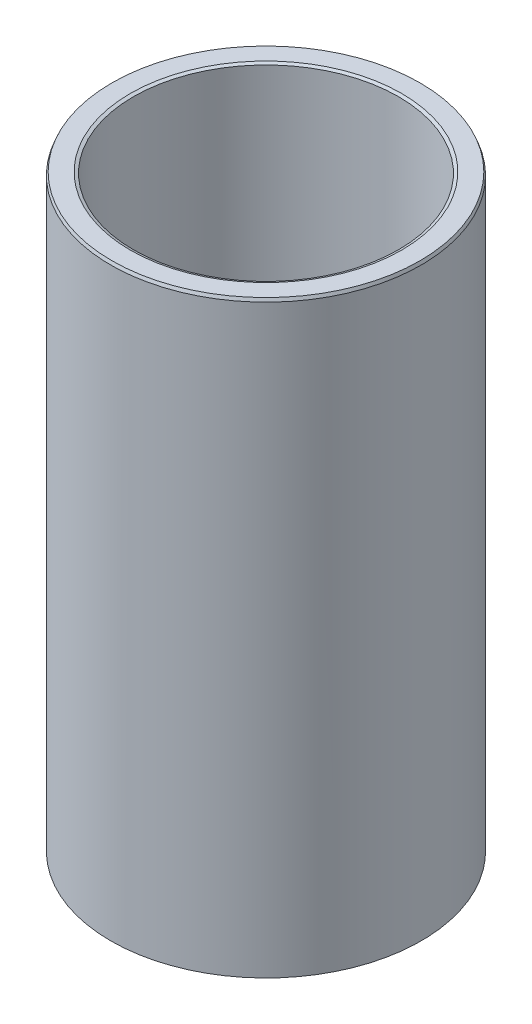
ISO-10303-21;
HEADER;
FILE_DESCRIPTION(('STEP AP214'),'2;1');
FILE_NAME('part.step','',(''),(''),'','','');
FILE_SCHEMA(('AUTOMOTIVE_DESIGN { 1 0 10303 214 1 1 1 1 }'));
ENDSEC;
DATA;
#1=APPLICATION_CONTEXT('core data for automotive mechanical design processes');
#2=APPLICATION_PROTOCOL_DEFINITION('international standard','automotive_design',2000,#1);
#3=PRODUCT_CONTEXT('',#1,'mechanical');
#4=PRODUCT('Part','Part','',(#3));
#5=PRODUCT_RELATED_PRODUCT_CATEGORY('part','',(#4));
#6=PRODUCT_DEFINITION_FORMATION('','',#4);
#7=PRODUCT_DEFINITION_CONTEXT('part definition',#1,'design');
#8=PRODUCT_DEFINITION('design','',#6,#7);
#9=PRODUCT_DEFINITION_SHAPE('','',#8);
#10=(LENGTH_UNIT() NAMED_UNIT(*) SI_UNIT(.MILLI.,.METRE.));
#11=(NAMED_UNIT(*) PLANE_ANGLE_UNIT() SI_UNIT($,.RADIAN.));
#12=(NAMED_UNIT(*) SI_UNIT($,.STERADIAN.) SOLID_ANGLE_UNIT());
#13=UNCERTAINTY_MEASURE_WITH_UNIT(LENGTH_MEASURE(1.E-05),#10,'distance_accuracy_value','');
#14=(GEOMETRIC_REPRESENTATION_CONTEXT(3) GLOBAL_UNCERTAINTY_ASSIGNED_CONTEXT((#13)) GLOBAL_UNIT_ASSIGNED_CONTEXT((#10,
#11,#12)) REPRESENTATION_CONTEXT('',''));
#15=CARTESIAN_POINT('',(0.,0.,0.));
#16=DIRECTION('',(0.,0.,1.));
#17=DIRECTION('',(1.,0.,0.));
#18=AXIS2_PLACEMENT_3D('',#15,#16,#17);
#19=CARTESIAN_POINT('',(0.,132.90604901803,0.));
#20=DIRECTION('',(0.,-1.,0.));
#21=DIRECTION('',(0.,0.,-1.));
#22=AXIS2_PLACEMENT_3D('',#19,#20,#21);
#23=CYLINDRICAL_SURFACE('',#22,35.);
#24=CARTESIAN_POINT('',(0.,0.274392453950084,0.));
#25=DIRECTION('',(0.,1.,0.));
#26=DIRECTION('',(0.,0.,1.));
#27=AXIS2_PLACEMENT_3D('',#24,#25,#26);
#28=CIRCLE('',#27,35.);
#29=CARTESIAN_POINT('',(0.,0.274392453950084,35.));
#30=VERTEX_POINT('',#29);
#31=EDGE_CURVE('E10',#30,#30,#28,.T.);
#32=ORIENTED_EDGE('',*,*,#31,.T.);
#33=EDGE_LOOP('',(#32));
#34=FACE_BOUND('',#33,.T.);
#35=CARTESIAN_POINT('',(0.,132.203450760462,0.));
#36=DIRECTION('',(0.,1.,0.));
#37=DIRECTION('',(0.,0.,1.));
#38=AXIS2_PLACEMENT_3D('',#35,#36,#37);
#39=CIRCLE('',#38,35.);
#40=CARTESIAN_POINT('',(0.,132.203450760462,-35.));
#41=VERTEX_POINT('',#40);
#42=EDGE_CURVE('E50',#41,#41,#39,.F.);
#43=ORIENTED_EDGE('',*,*,#42,.T.);
#44=EDGE_LOOP('',(#43));
#45=FACE_BOUND('',#44,.T.);
#46=ADVANCED_FACE('F39',(#34,#45),#23,.T.);
#47=CARTESIAN_POINT('',(0.,132.90604901803,0.));
#48=DIRECTION('',(0.,1.,0.));
#49=DIRECTION('',(0.,0.,1.));
#50=AXIS2_PLACEMENT_3D('',#47,#48,#49);
#51=PLANE('',#50);
#52=CARTESIAN_POINT('',(0.,132.90604901803,0.));
#53=DIRECTION('',(0.,1.,0.));
#54=DIRECTION('',(0.,0.,1.));
#55=AXIS2_PLACEMENT_3D('',#52,#53,#54);
#56=CIRCLE('',#55,30.5849243006841);
#57=CARTESIAN_POINT('',(0.,132.90604901803,30.5849243006841));
#58=VERTEX_POINT('',#57);
#59=EDGE_CURVE('E58',#58,#58,#56,.F.);
#60=ORIENTED_EDGE('',*,*,#59,.T.);
#61=EDGE_LOOP('',(#60));
#62=FACE_BOUND('',#61,.T.);
#63=CARTESIAN_POINT('',(0.,132.90604901803,0.));
#64=DIRECTION('',(0.,1.,0.));
#65=DIRECTION('',(0.,0.,1.));
#66=AXIS2_PLACEMENT_3D('',#63,#64,#65);
#67=CIRCLE('',#66,34.7256075460499);
#68=CARTESIAN_POINT('',(0.,132.90604901803,-34.7256075460499));
#69=VERTEX_POINT('',#68);
#70=EDGE_CURVE('E61',#69,#69,#67,.T.);
#71=ORIENTED_EDGE('',*,*,#70,.T.);
#72=EDGE_LOOP('',(#71));
#73=FACE_BOUND('',#72,.T.);
#74=ADVANCED_FACE('F88',(#62,#73),#51,.T.);
#75=CARTESIAN_POINT('',(0.,0.,0.));
#76=DIRECTION('',(0.,1.,0.));
#77=DIRECTION('',(0.,0.,1.));
#78=AXIS2_PLACEMENT_3D('',#75,#76,#77);
#79=PLANE('',#78);
#80=CARTESIAN_POINT('',(0.,0.,0.));
#81=DIRECTION('',(0.,1.,0.));
#82=DIRECTION('',(0.,0.,1.));
#83=AXIS2_PLACEMENT_3D('',#80,#81,#82);
#84=CIRCLE('',#83,30.1567184970663);
#85=CARTESIAN_POINT('',(0.,0.,-30.1567184970663));
#86=VERTEX_POINT('',#85);
#87=EDGE_CURVE('E51',#86,#86,#84,.T.);
#88=ORIENTED_EDGE('',*,*,#87,.T.);
#89=EDGE_LOOP('',(#88));
#90=FACE_BOUND('',#89,.T.);
#91=CARTESIAN_POINT('',(0.,0.,0.));
#92=DIRECTION('',(0.,1.,0.));
#93=DIRECTION('',(0.,0.,1.));
#94=AXIS2_PLACEMENT_3D('',#91,#92,#93);
#95=CIRCLE('',#94,34.2974017424321);
#96=CARTESIAN_POINT('',(0.,0.,34.2974017424321));
#97=VERTEX_POINT('',#96);
#98=EDGE_CURVE('E54',#97,#97,#95,.F.);
#99=ORIENTED_EDGE('',*,*,#98,.T.);
#100=EDGE_LOOP('',(#99));
#101=FACE_BOUND('',#100,.T.);
#102=ADVANCED_FACE('F83',(#90,#101),#79,.F.);
#103=CARTESIAN_POINT('',(0.,132.90604901803,0.));
#104=DIRECTION('',(0.,-1.,0.));
#105=DIRECTION('',(0.,0.,-1.));
#106=AXIS2_PLACEMENT_3D('',#103,#104,#105);
#107=CYLINDRICAL_SURFACE('',#106,29.8823260431162);
#108=CARTESIAN_POINT('',(0.,132.63165656408,0.));
#109=DIRECTION('',(0.,1.,0.));
#110=DIRECTION('',(0.,0.,1.));
#111=AXIS2_PLACEMENT_3D('',#108,#109,#110);
#112=CIRCLE('',#111,29.8823260431162);
#113=CARTESIAN_POINT('',(0.,132.63165656408,29.8823260431162));
#114=VERTEX_POINT('',#113);
#115=EDGE_CURVE('E67',#114,#114,#112,.T.);
#116=ORIENTED_EDGE('',*,*,#115,.T.);
#117=EDGE_LOOP('',(#116));
#118=FACE_BOUND('',#117,.T.);
#119=CARTESIAN_POINT('',(0.,0.702598257567882,0.));
#120=DIRECTION('',(0.,1.,0.));
#121=DIRECTION('',(0.,0.,1.));
#122=AXIS2_PLACEMENT_3D('',#119,#120,#121);
#123=CIRCLE('',#122,29.8823260431162);
#124=CARTESIAN_POINT('',(0.,0.702598257567882,-29.8823260431162));
#125=VERTEX_POINT('',#124);
#126=EDGE_CURVE('E69',#125,#125,#123,.F.);
#127=ORIENTED_EDGE('',*,*,#126,.T.);
#128=EDGE_LOOP('',(#127));
#129=FACE_BOUND('',#128,.T.);
#130=ADVANCED_FACE('F71',(#118,#129),#107,.F.);
#131=CARTESIAN_POINT('',(0.,132.63165656408,0.));
#132=DIRECTION('',(0.,1.,0.));
#133=DIRECTION('',(0.,0.,1.));
#134=AXIS2_PLACEMENT_3D('',#131,#132,#133);
#135=CONICAL_SURFACE('',#134,29.8823260431162,1.19847196221955);
#136=ORIENTED_EDGE('',*,*,#59,.F.);
#137=EDGE_LOOP('',(#136));
#138=FACE_BOUND('',#137,.T.);
#139=ORIENTED_EDGE('',*,*,#115,.F.);
#140=EDGE_LOOP('',(#139));
#141=FACE_BOUND('',#140,.T.);
#142=ADVANCED_FACE('F77',(#138,#141),#135,.F.);
#143=CARTESIAN_POINT('',(0.,0.,0.));
#144=DIRECTION('',(0.,-1.,0.));
#145=DIRECTION('',(0.,0.,-1.));
#146=AXIS2_PLACEMENT_3D('',#143,#144,#145);
#147=CONICAL_SURFACE('',#146,30.1567184970663,0.372324364575318);
#148=CARTESIAN_POINT('',(0.,0.702598257567882,-29.8823260431162));
#149=CARTESIAN_POINT('',(0.,0.695279525718217,-29.8851842978449));
#150=CARTESIAN_POINT('',(0.,0.687960793868552,-29.8880425525735));
#151=CARTESIAN_POINT('',(0.,0.673323330169221,-29.8937590620308));
#152=CARTESIAN_POINT('',(0.,0.666004598319555,-29.8966173167594));
#153=CARTESIAN_POINT('',(0.,0.651367134620224,-29.9023338262167));
#154=CARTESIAN_POINT('',(0.,0.644048402770559,-29.9051920809454));
#155=CARTESIAN_POINT('',(0.,0.629410939071228,-29.9109085904027));
#156=CARTESIAN_POINT('',(0.,0.622092207221562,-29.9137668451313));
#157=CARTESIAN_POINT('',(0.,0.607454743522232,-29.9194833545886));
#158=CARTESIAN_POINT('',(0.,0.600136011672566,-29.9223416093173));
#159=CARTESIAN_POINT('',(0.,0.585498547973235,-29.9280581187746));
#160=CARTESIAN_POINT('',(0.,0.57817981612357,-29.9309163735032));
#161=CARTESIAN_POINT('',(0.,0.563542352424239,-29.9366328829605));
#162=CARTESIAN_POINT('',(0.,0.556223620574573,-29.9394911376891));
#163=CARTESIAN_POINT('',(0.,0.541586156875243,-29.9452076471464));
#164=CARTESIAN_POINT('',(0.,0.534267425025577,-29.9480659018751));
#165=CARTESIAN_POINT('',(0.,0.519629961326246,-29.9537824113324));
#166=CARTESIAN_POINT('',(0.,0.512311229476581,-29.956640666061));
#167=CARTESIAN_POINT('',(0.,0.49767376577725,-29.9623571755183));
#168=CARTESIAN_POINT('',(0.,0.490355033927585,-29.965215430247));
#169=CARTESIAN_POINT('',(0.,0.475717570228254,-29.9709319397042));
#170=CARTESIAN_POINT('',(0.,0.468398838378588,-29.9737901944329));
#171=CARTESIAN_POINT('',(0.,0.453761374679257,-29.9795067038902));
#172=CARTESIAN_POINT('',(0.,0.446442642829592,-29.9823649586188));
#173=CARTESIAN_POINT('',(0.,0.431805179130261,-29.9880814680761));
#174=CARTESIAN_POINT('',(0.,0.424486447280595,-29.9909397228048));
#175=CARTESIAN_POINT('',(0.,0.409848983581264,-29.9966562322621));
#176=CARTESIAN_POINT('',(0.,0.402530251731599,-29.9995144869907));
#177=CARTESIAN_POINT('',(0.,0.387892788032269,-30.005230996448));
#178=CARTESIAN_POINT('',(0.,0.380574056182603,-30.0080892511767));
#179=CARTESIAN_POINT('',(0.,0.365936592483272,-30.013805760634));
#180=CARTESIAN_POINT('',(0.,0.358617860633606,-30.0166640153626));
#181=CARTESIAN_POINT('',(0.,0.343980396934275,-30.0223805248199));
#182=CARTESIAN_POINT('',(0.,0.33666166508461,-30.0252387795485));
#183=CARTESIAN_POINT('',(0.,0.322024201385279,-30.0309552890058));
#184=CARTESIAN_POINT('',(0.,0.314705469535614,-30.0338135437345));
#185=CARTESIAN_POINT('',(0.,0.300068005836283,-30.0395300531918));
#186=CARTESIAN_POINT('',(0.,0.292749273986618,-30.0423883079204));
#187=CARTESIAN_POINT('',(0.,0.278111810287287,-30.0481048173777));
#188=CARTESIAN_POINT('',(0.,0.270793078437621,-30.0509630721064));
#189=CARTESIAN_POINT('',(0.,0.25615561473829,-30.0566795815636));
#190=CARTESIAN_POINT('',(0.,0.248836882888625,-30.0595378362923));
#191=CARTESIAN_POINT('',(0.,0.234199419189294,-30.0652543457496));
#192=CARTESIAN_POINT('',(0.,0.226880687339629,-30.0681126004782));
#193=CARTESIAN_POINT('',(0.,0.212243223640298,-30.0738291099355));
#194=CARTESIAN_POINT('',(0.,0.204924491790633,-30.0766873646642));
#195=CARTESIAN_POINT('',(0.,0.190287028091302,-30.0824038741215));
#196=CARTESIAN_POINT('',(0.,0.182968296241636,-30.0852621288501));
#197=CARTESIAN_POINT('',(0.,0.168330832542305,-30.0909786383074));
#198=CARTESIAN_POINT('',(0.,0.16101210069264,-30.0938368930361));
#199=CARTESIAN_POINT('',(0.,0.146374636993309,-30.0995534024933));
#200=CARTESIAN_POINT('',(0.,0.139055905143644,-30.102411657222));
#201=CARTESIAN_POINT('',(0.,0.124418441444313,-30.1081281666793));
#202=CARTESIAN_POINT('',(0.,0.117099709594647,-30.1109864214079));
#203=CARTESIAN_POINT('',(0.,0.102462245895316,-30.1167029308652));
#204=CARTESIAN_POINT('',(0.,0.0951435140456507,-30.1195611855939));
#205=CARTESIAN_POINT('',(0.,0.0805060503463199,-30.1252776950512));
#206=CARTESIAN_POINT('',(0.,0.0731873184966544,-30.1281359497798));
#207=CARTESIAN_POINT('',(0.,0.0585498547973236,-30.1338524592371));
#208=CARTESIAN_POINT('',(0.,0.0512311229476583,-30.1367107139658));
#209=CARTESIAN_POINT('',(0.,0.0365936592483274,-30.142427223423));
#210=CARTESIAN_POINT('',(0.,0.0292749273986618,-30.1452854781517));
#211=CARTESIAN_POINT('',(0.,0.0146374636993305,-30.151001987609));
#212=CARTESIAN_POINT('',(0.,0.00731873184966487,-30.1538602423376));
#213=CARTESIAN_POINT('',(0.,0.,-30.1567184970663));
#214=B_SPLINE_CURVE_WITH_KNOTS('',3,(#148,#149,#150,#151,#152,#153,#154,#155,#156,#157,#158,
#159,#160,#161,#162,#163,#164,#165,#166,#167,#168,#169,#170,#171,#172,#173,#174,#175,#176,#177,
#178,#179,#180,#181,#182,#183,#184,#185,#186,#187,#188,#189,#190,#191,#192,#193,#194,#195,#196,
#197,#198,#199,#200,#201,#202,#203,#204,#205,#206,#207,#208,#209,#210,#211,#212,#213),
.UNSPECIFIED.,.F.,.F.,(4,2,2,2,2,2,2,2,2,2,2,2,2,2,2,2,2,2,2,2,2,2,2,2,2,2,2,2,2,2,2,2,4),(0.,
0.0235711922445655,0.0471423844891296,0.0707135767336951,0.0942847689782605,0.117855961222826,
0.14142715346739,0.164998345711956,0.188569537956521,0.212140730201085,0.235711922445651,
0.259283114690216,0.282854306934782,0.306425499179346,0.329996691423911,0.353567883668477,
0.377139075913041,0.400710268157606,0.424281460402172,0.447852652646737,0.471423844891301,
0.494995037135867,0.518566229380432,0.542137421624998,0.565708613869562,0.589279806114127,
0.612850998358693,0.636422190603257,0.659993382847822,0.683564575092388,0.707135767336953,
0.730706959581517,0.754278151826083),.UNSPECIFIED.);
#215=EDGE_CURVE('BSEAM73',#125,#86,#214,.T.);
#216=ORIENTED_EDGE('',*,*,#126,.F.);
#217=ORIENTED_EDGE('',*,*,#87,.F.);
#218=ORIENTED_EDGE('',*,*,#215,.T.);
#219=ORIENTED_EDGE('',*,*,#215,.F.);
#220=EDGE_LOOP('',(#216,#218,#217,#219));
#221=FACE_BOUND('',#220,.T.);
#222=ADVANCED_FACE('F73',(#221),#147,.F.);
#223=CARTESIAN_POINT('',(0.,0.274392453950084,0.));
#224=DIRECTION('',(0.,1.,0.));
#225=DIRECTION('',(0.,0.,1.));
#226=AXIS2_PLACEMENT_3D('',#223,#224,#225);
#227=CONICAL_SURFACE('',#226,35.,1.19847196221958);
#228=ORIENTED_EDGE('',*,*,#98,.F.);
#229=EDGE_LOOP('',(#228));
#230=FACE_BOUND('',#229,.T.);
#231=ORIENTED_EDGE('',*,*,#31,.F.);
#232=EDGE_LOOP('',(#231));
#233=FACE_BOUND('',#232,.T.);
#234=ADVANCED_FACE('F76',(#230,#233),#227,.T.);
#235=CARTESIAN_POINT('',(0.,132.90604901803,0.));
#236=DIRECTION('',(0.,-1.,0.));
#237=DIRECTION('',(0.,0.,-1.));
#238=AXIS2_PLACEMENT_3D('',#235,#236,#237);
#239=CONICAL_SURFACE('',#238,34.7256075460499,0.37232436457534);
#240=CARTESIAN_POINT('',(0.,132.203450760462,-35.));
#241=CARTESIAN_POINT('',(0.,132.210769492312,-34.9971417452714));
#242=CARTESIAN_POINT('',(0.,132.218088224162,-34.9942834905427));
#243=CARTESIAN_POINT('',(0.,132.232725687861,-34.9885669810854));
#244=CARTESIAN_POINT('',(0.,132.240044419711,-34.9857087263568));
#245=CARTESIAN_POINT('',(0.,132.25468188341,-34.9799922168995));
#246=CARTESIAN_POINT('',(0.,132.26200061526,-34.9771339621708));
#247=CARTESIAN_POINT('',(0.,132.276638078959,-34.9714174527136));
#248=CARTESIAN_POINT('',(0.,132.283956810809,-34.9685591979849));
#249=CARTESIAN_POINT('',(0.,132.298594274508,-34.9628426885276));
#250=CARTESIAN_POINT('',(0.,132.305913006358,-34.959984433799));
#251=CARTESIAN_POINT('',(0.,132.320550470057,-34.9542679243417));
#252=CARTESIAN_POINT('',(0.,132.327869201907,-34.951409669613));
#253=CARTESIAN_POINT('',(0.,132.342506665606,-34.9456931601557));
#254=CARTESIAN_POINT('',(0.,132.349825397456,-34.9428349054271));
#255=CARTESIAN_POINT('',(0.,132.364462861155,-34.9371183959698));
#256=CARTESIAN_POINT('',(0.,132.371781593005,-34.9342601412411));
#257=CARTESIAN_POINT('',(0.,132.386419056704,-34.9285436317838));
#258=CARTESIAN_POINT('',(0.,132.393737788554,-34.9256853770552));
#259=CARTESIAN_POINT('',(0.,132.408375252253,-34.9199688675979));
#260=CARTESIAN_POINT('',(0.,132.415693984103,-34.9171106128693));
#261=CARTESIAN_POINT('',(0.,132.430331447802,-34.911394103412));
#262=CARTESIAN_POINT('',(0.,132.437650179652,-34.9085358486833));
#263=CARTESIAN_POINT('',(0.,132.452287643351,-34.902819339226));
#264=CARTESIAN_POINT('',(0.,132.459606375201,-34.8999610844974));
#265=CARTESIAN_POINT('',(0.,132.4742438389,-34.8942445750401));
#266=CARTESIAN_POINT('',(0.,132.48156257075,-34.8913863203114));
#267=CARTESIAN_POINT('',(0.,132.496200034449,-34.8856698108541));
#268=CARTESIAN_POINT('',(0.,132.503518766299,-34.8828115561255));
#269=CARTESIAN_POINT('',(0.,132.518156229998,-34.8770950466682));
#270=CARTESIAN_POINT('',(0.,132.525474961848,-34.8742367919396));
#271=CARTESIAN_POINT('',(0.,132.540112425547,-34.8685202824823));
#272=CARTESIAN_POINT('',(0.,132.547431157397,-34.8656620277536));
#273=CARTESIAN_POINT('',(0.,132.562068621096,-34.8599455182963));
#274=CARTESIAN_POINT('',(0.,132.569387352946,-34.8570872635677));
#275=CARTESIAN_POINT('',(0.,132.584024816645,-34.8513707541104));
#276=CARTESIAN_POINT('',(0.,132.591343548495,-34.8485124993817));
#277=CARTESIAN_POINT('',(0.,132.605981012194,-34.8427959899244));
#278=CARTESIAN_POINT('',(0.,132.613299744044,-34.8399377351958));
#279=CARTESIAN_POINT('',(0.,132.627937207743,-34.8342212257385));
#280=CARTESIAN_POINT('',(0.,132.635255939593,-34.8313629710099));
#281=CARTESIAN_POINT('',(0.,132.649893403292,-34.8256464615526));
#282=CARTESIAN_POINT('',(0.,132.657212135142,-34.8227882068239));
#283=CARTESIAN_POINT('',(0.,132.671849598841,-34.8170716973666));
#284=CARTESIAN_POINT('',(0.,132.679168330691,-34.814213442638));
#285=CARTESIAN_POINT('',(0.,132.69380579439,-34.8084969331807));
#286=CARTESIAN_POINT('',(0.,132.70112452624,-34.805638678452));
#287=CARTESIAN_POINT('',(0.,132.715761989939,-34.7999221689947));
#288=CARTESIAN_POINT('',(0.,132.723080721789,-34.7970639142661));
#289=CARTESIAN_POINT('',(0.,132.737718185488,-34.7913474048088));
#290=CARTESIAN_POINT('',(0.,132.745036917338,-34.7884891500801));
#291=CARTESIAN_POINT('',(0.,132.759674381037,-34.7827726406229));
#292=CARTESIAN_POINT('',(0.,132.766993112887,-34.7799143858942));
#293=CARTESIAN_POINT('',(0.,132.781630576586,-34.7741978764369));
#294=CARTESIAN_POINT('',(0.,132.788949308436,-34.7713396217083));
#295=CARTESIAN_POINT('',(0.,132.803586772135,-34.765623112251));
#296=CARTESIAN_POINT('',(0.,132.810905503985,-34.7627648575223));
#297=CARTESIAN_POINT('',(0.,132.825542967684,-34.757048348065));
#298=CARTESIAN_POINT('',(0.,132.832861699534,-34.7541900933364));
#299=CARTESIAN_POINT('',(0.,132.847499163233,-34.7484735838791));
#300=CARTESIAN_POINT('',(0.,132.854817895083,-34.7456153291505));
#301=CARTESIAN_POINT('',(0.,132.869455358782,-34.7398988196932));
#302=CARTESIAN_POINT('',(0.,132.876774090631,-34.7370405649645));
#303=CARTESIAN_POINT('',(0.,132.891411554331,-34.7313240555072));
#304=CARTESIAN_POINT('',(0.,132.898730286181,-34.7284658007786));
#305=CARTESIAN_POINT('',(0.,132.90604901803,-34.7256075460499));
#306=B_SPLINE_CURVE_WITH_KNOTS('',3,(#240,#241,#242,#243,#244,#245,#246,#247,#248,#249,#250,
#251,#252,#253,#254,#255,#256,#257,#258,#259,#260,#261,#262,#263,#264,#265,#266,#267,#268,#269,
#270,#271,#272,#273,#274,#275,#276,#277,#278,#279,#280,#281,#282,#283,#284,#285,#286,#287,#288,
#289,#290,#291,#292,#293,#294,#295,#296,#297,#298,#299,#300,#301,#302,#303,#304,#305),
.UNSPECIFIED.,.F.,.F.,(4,2,2,2,2,2,2,2,2,2,2,2,2,2,2,2,2,2,2,2,2,2,2,2,2,2,2,2,2,2,2,2,4),(0.,
0.0235711922445792,0.0471423844891325,0.0707135767337117,0.094284768978265,0.117855961222844,
0.141427153467398,0.164998345711977,0.18856953795653,0.212140730201109,0.235711922445663,
0.259283114690242,0.282854306934793,0.306425499179372,0.329996691423925,0.353567883668504,
0.377139075913058,0.400710268157611,0.42428146040219,0.447852652646744,0.471423844891323,
0.494995037135876,0.518566229380455,0.542137421625009,0.565708613869588,0.589279806114141,
0.61285099835872,0.636422190603274,0.65999338284785,0.683564575092404,0.707135767336983,
0.730706959581536,0.754278151826115),.UNSPECIFIED.);
#307=EDGE_CURVE('BSEAM45',#41,#69,#306,.T.);
#308=ORIENTED_EDGE('',*,*,#42,.F.);
#309=ORIENTED_EDGE('',*,*,#70,.F.);
#310=ORIENTED_EDGE('',*,*,#307,.T.);
#311=ORIENTED_EDGE('',*,*,#307,.F.);
#312=EDGE_LOOP('',(#308,#310,#309,#311));
#313=FACE_BOUND('',#312,.T.);
#314=ADVANCED_FACE('F45',(#313),#239,.T.);
#315=CLOSED_SHELL('',(#46,#74,#102,#130,#142,#222,#234,#314));
#316=MANIFOLD_SOLID_BREP('B2',#315);
#317=ADVANCED_BREP_SHAPE_REPRESENTATION('',(#18,#316),#14);
#318=SHAPE_DEFINITION_REPRESENTATION(#9,#317);
ENDSEC;
END-ISO-10303-21;
